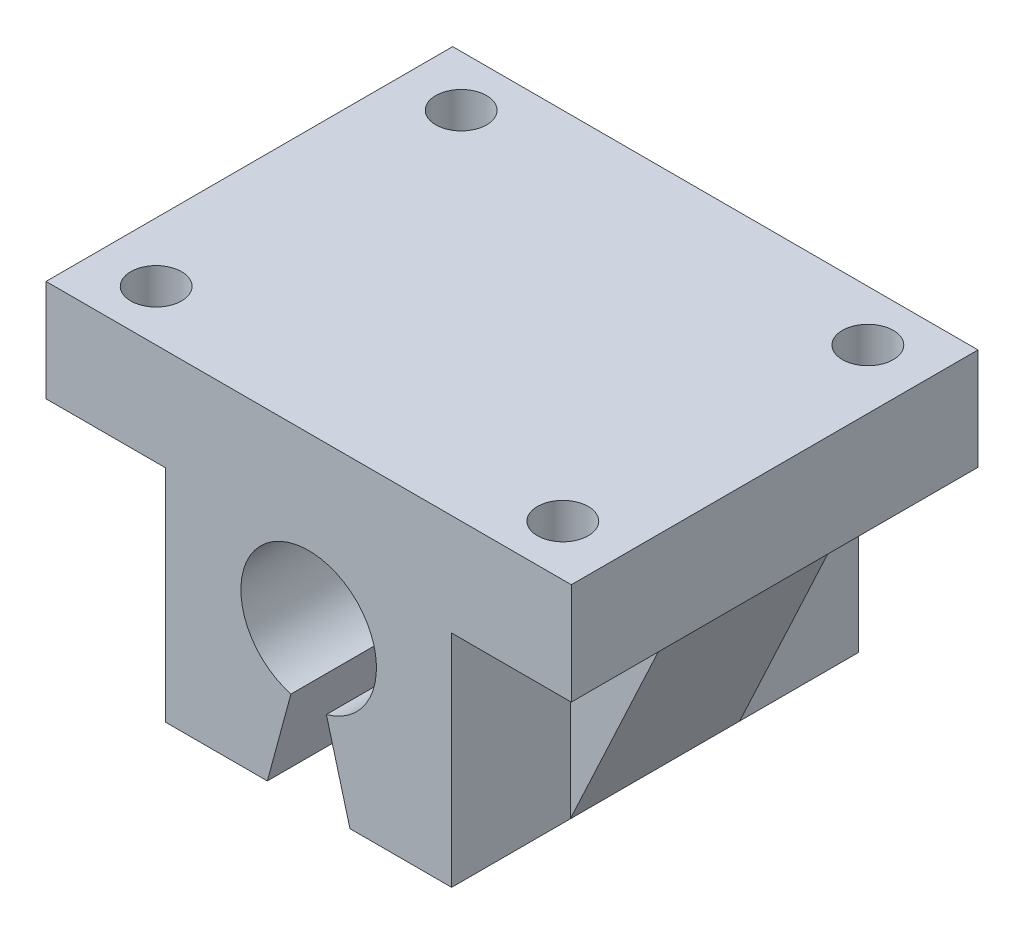
ISO-10303-21;
HEADER;
FILE_DESCRIPTION(('STEP AP214'),'2;1');
FILE_NAME('part.step','',(''),(''),'','','');
FILE_SCHEMA(('AUTOMOTIVE_DESIGN { 1 0 10303 214 1 1 1 1 }'));
ENDSEC;
DATA;
#1=APPLICATION_CONTEXT('core data for automotive mechanical design processes');
#2=APPLICATION_PROTOCOL_DEFINITION('international standard','automotive_design',2000,#1);
#3=PRODUCT_CONTEXT('',#1,'mechanical');
#4=PRODUCT('Part','Part','',(#3));
#5=PRODUCT_RELATED_PRODUCT_CATEGORY('part','',(#4));
#6=PRODUCT_DEFINITION_FORMATION('','',#4);
#7=PRODUCT_DEFINITION_CONTEXT('part definition',#1,'design');
#8=PRODUCT_DEFINITION('design','',#6,#7);
#9=PRODUCT_DEFINITION_SHAPE('','',#8);
#10=(LENGTH_UNIT() NAMED_UNIT(*) SI_UNIT(.MILLI.,.METRE.));
#11=(NAMED_UNIT(*) PLANE_ANGLE_UNIT() SI_UNIT($,.RADIAN.));
#12=(NAMED_UNIT(*) SI_UNIT($,.STERADIAN.) SOLID_ANGLE_UNIT());
#13=UNCERTAINTY_MEASURE_WITH_UNIT(LENGTH_MEASURE(1.E-05),#10,'distance_accuracy_value','');
#14=(GEOMETRIC_REPRESENTATION_CONTEXT(3) GLOBAL_UNCERTAINTY_ASSIGNED_CONTEXT((#13)) GLOBAL_UNIT_ASSIGNED_CONTEXT((#10,
#11,#12)) REPRESENTATION_CONTEXT('',''));
#15=CARTESIAN_POINT('',(0.,0.,0.));
#16=DIRECTION('',(0.,0.,1.));
#17=DIRECTION('',(1.,0.,0.));
#18=AXIS2_PLACEMENT_3D('',#15,#16,#17);
#19=CARTESIAN_POINT('',(0.,-6.,12.));
#20=DIRECTION('',(0.,1.,0.));
#21=DIRECTION('',(0.,0.,1.));
#22=AXIS2_PLACEMENT_3D('',#19,#20,#21);
#23=PLANE('',#22);
#24=CARTESIAN_POINT('',(-12.,-6.,9.));
#25=DIRECTION('',(0.,1.,0.));
#26=DIRECTION('',(0.,0.,1.));
#27=AXIS2_PLACEMENT_3D('',#24,#25,#26);
#28=CIRCLE('',#27,1.5);
#29=CARTESIAN_POINT('',(-12.,-6.,10.5));
#30=VERTEX_POINT('',#29);
#31=EDGE_CURVE('E581',#30,#30,#28,.F.);
#32=ORIENTED_EDGE('',*,*,#31,.F.);
#33=EDGE_LOOP('',(#32));
#34=FACE_BOUND('',#33,.T.);
#35=CARTESIAN_POINT('',(-12.,-6.,-9.));
#36=DIRECTION('',(0.,1.,0.));
#37=DIRECTION('',(0.,0.,1.));
#38=AXIS2_PLACEMENT_3D('',#35,#36,#37);
#39=CIRCLE('',#38,1.5);
#40=CARTESIAN_POINT('',(-12.,-6.,-7.5));
#41=VERTEX_POINT('',#40);
#42=EDGE_CURVE('E593',#41,#41,#39,.F.);
#43=ORIENTED_EDGE('',*,*,#42,.F.);
#44=EDGE_LOOP('',(#43));
#45=FACE_BOUND('',#44,.T.);
#46=DIRECTION('',(-1.,0.,0.));
#47=VECTOR('',#46,1.);
#48=CARTESIAN_POINT('',(-14.5,-6.,5.));
#49=LINE('',#48,#47);
#50=CARTESIAN_POINT('',(-8.43800044398506,-6.,5.));
#51=VERTEX_POINT('',#50);
#52=CARTESIAN_POINT('',(-14.5,-6.,5.));
#53=VERTEX_POINT('',#52);
#54=EDGE_CURVE('E171',#51,#53,#49,.T.);
#55=ORIENTED_EDGE('',*,*,#54,.F.);
#56=DIRECTION('',(0.,0.,-1.));
#57=VECTOR('',#56,1.);
#58=CARTESIAN_POINT('',(-8.43800044398506,-6.,12.));
#59=LINE('',#58,#57);
#60=CARTESIAN_POINT('',(-8.43800044398506,-6.,12.));
#61=VERTEX_POINT('',#60);
#62=EDGE_CURVE('E268',#61,#51,#59,.T.);
#63=ORIENTED_EDGE('',*,*,#62,.F.);
#64=DIRECTION('',(1.,0.,0.));
#65=VECTOR('',#64,1.);
#66=CARTESIAN_POINT('',(0.,-6.,12.));
#67=LINE('',#66,#65);
#68=CARTESIAN_POINT('',(-15.5,-6.,12.));
#69=VERTEX_POINT('',#68);
#70=EDGE_CURVE('E222',#69,#61,#67,.T.);
#71=ORIENTED_EDGE('',*,*,#70,.F.);
#72=DIRECTION('',(0.,0.,-1.));
#73=VECTOR('',#72,1.);
#74=CARTESIAN_POINT('',(-15.5,-6.,12.));
#75=LINE('',#74,#73);
#76=CARTESIAN_POINT('',(-15.5,-6.,-12.));
#77=VERTEX_POINT('',#76);
#78=EDGE_CURVE('E270',#69,#77,#75,.T.);
#79=ORIENTED_EDGE('',*,*,#78,.T.);
#80=DIRECTION('',(1.,0.,0.));
#81=VECTOR('',#80,1.);
#82=CARTESIAN_POINT('',(0.,-6.,-12.));
#83=LINE('',#82,#81);
#84=CARTESIAN_POINT('',(-8.43800044398506,-6.,-12.));
#85=VERTEX_POINT('',#84);
#86=EDGE_CURVE('E249',#77,#85,#83,.T.);
#87=ORIENTED_EDGE('',*,*,#86,.T.);
#88=CARTESIAN_POINT('',(-8.43800044398506,-6.,-5.));
#89=VERTEX_POINT('',#88);
#90=EDGE_CURVE('E267',#89,#85,#59,.T.);
#91=ORIENTED_EDGE('',*,*,#90,.F.);
#92=DIRECTION('',(-1.,0.,0.));
#93=VECTOR('',#92,1.);
#94=CARTESIAN_POINT('',(-14.5,-6.,-5.));
#95=LINE('',#94,#93);
#96=CARTESIAN_POINT('',(-14.5,-6.,-5.));
#97=VERTEX_POINT('',#96);
#98=EDGE_CURVE('E180',#89,#97,#95,.T.);
#99=ORIENTED_EDGE('',*,*,#98,.T.);
#100=DIRECTION('',(0.,0.,-1.));
#101=VECTOR('',#100,1.);
#102=CARTESIAN_POINT('',(-14.5,-6.,5.));
#103=LINE('',#102,#101);
#104=EDGE_CURVE('E164',#53,#97,#103,.T.);
#105=ORIENTED_EDGE('',*,*,#104,.F.);
#106=EDGE_LOOP('',(#55,#63,#71,#79,#87,#91,#99,#105));
#107=FACE_BOUND('',#106,.T.);
#108=ADVANCED_FACE('F35',(#34,#45,#107),#23,.F.);
#109=CARTESIAN_POINT('',(-8.43800044398506,0.,12.));
#110=DIRECTION('',(1.,0.,0.));
#111=DIRECTION('',(0.,1.,0.));
#112=AXIS2_PLACEMENT_3D('',#109,#110,#111);
#113=PLANE('',#112);
#114=DIRECTION('',(0.,1.,0.));
#115=VECTOR('',#114,1.);
#116=CARTESIAN_POINT('',(-8.43800044398506,-6.,5.));
#117=LINE('',#116,#115);
#118=CARTESIAN_POINT('',(-8.43800044398506,-19.,5.));
#119=VERTEX_POINT('',#118);
#120=EDGE_CURVE('E170',#119,#51,#117,.T.);
#121=ORIENTED_EDGE('',*,*,#120,.F.);
#122=DIRECTION('',(0.,0.,-1.));
#123=VECTOR('',#122,1.);
#124=CARTESIAN_POINT('',(-8.43800044398506,-19.,12.));
#125=LINE('',#124,#123);
#126=CARTESIAN_POINT('',(-8.43800044398506,-19.,12.));
#127=VERTEX_POINT('',#126);
#128=EDGE_CURVE('E264',#127,#119,#125,.T.);
#129=ORIENTED_EDGE('',*,*,#128,.F.);
#130=DIRECTION('',(0.,-1.,0.));
#131=VECTOR('',#130,1.);
#132=CARTESIAN_POINT('',(-8.43800044398506,0.,12.));
#133=LINE('',#132,#131);
#134=EDGE_CURVE('E224',#61,#127,#133,.T.);
#135=ORIENTED_EDGE('',*,*,#134,.F.);
#136=ORIENTED_EDGE('',*,*,#62,.T.);
#137=EDGE_LOOP('',(#121,#129,#135,#136));
#138=FACE_BOUND('',#137,.T.);
#139=ADVANCED_FACE('F371',(#138),#113,.F.);
#140=CARTESIAN_POINT('',(8.43800044398507,0.,12.));
#141=DIRECTION('',(-1.,0.,0.));
#142=DIRECTION('',(0.,0.,1.));
#143=AXIS2_PLACEMENT_3D('',#140,#141,#142);
#144=PLANE('',#143);
#145=DIRECTION('',(0.,-1.,0.));
#146=VECTOR('',#145,1.);
#147=CARTESIAN_POINT('',(8.43800044398507,-19.,5.));
#148=LINE('',#147,#146);
#149=CARTESIAN_POINT('',(8.43800044398507,-6.,5.));
#150=VERTEX_POINT('',#149);
#151=CARTESIAN_POINT('',(8.43800044398507,-19.,5.));
#152=VERTEX_POINT('',#151);
#153=EDGE_CURVE('E187',#150,#152,#148,.T.);
#154=ORIENTED_EDGE('',*,*,#153,.F.);
#155=DIRECTION('',(0.,0.,-1.));
#156=VECTOR('',#155,1.);
#157=CARTESIAN_POINT('',(8.43800044398507,-6.,12.));
#158=LINE('',#157,#156);
#159=CARTESIAN_POINT('',(8.43800044398507,-6.,12.));
#160=VERTEX_POINT('',#159);
#161=EDGE_CURVE('E283',#160,#150,#158,.T.);
#162=ORIENTED_EDGE('',*,*,#161,.F.);
#163=DIRECTION('',(0.,1.,0.));
#164=VECTOR('',#163,1.);
#165=CARTESIAN_POINT('',(8.43800044398507,0.,12.));
#166=LINE('',#165,#164);
#167=CARTESIAN_POINT('',(8.43800044398507,-19.,12.));
#168=VERTEX_POINT('',#167);
#169=EDGE_CURVE('E212',#168,#160,#166,.T.);
#170=ORIENTED_EDGE('',*,*,#169,.F.);
#171=DIRECTION('',(0.,0.,-1.));
#172=VECTOR('',#171,1.);
#173=CARTESIAN_POINT('',(8.43800044398507,-19.,12.));
#174=LINE('',#173,#172);
#175=EDGE_CURVE('E287',#168,#152,#174,.T.);
#176=ORIENTED_EDGE('',*,*,#175,.T.);
#177=EDGE_LOOP('',(#154,#162,#170,#176));
#178=FACE_BOUND('',#177,.T.);
#179=ADVANCED_FACE('F314',(#178),#144,.F.);
#180=CARTESIAN_POINT('',(0.,-6.,12.));
#181=DIRECTION('',(0.,1.,0.));
#182=DIRECTION('',(0.,0.,1.));
#183=AXIS2_PLACEMENT_3D('',#180,#181,#182);
#184=PLANE('',#183);
#185=CARTESIAN_POINT('',(12.,-6.,9.));
#186=DIRECTION('',(0.,1.,0.));
#187=DIRECTION('',(0.,0.,1.));
#188=AXIS2_PLACEMENT_3D('',#185,#186,#187);
#189=CIRCLE('',#188,1.5);
#190=CARTESIAN_POINT('',(12.,-6.,10.5));
#191=VERTEX_POINT('',#190);
#192=EDGE_CURVE('E585',#191,#191,#189,.F.);
#193=ORIENTED_EDGE('',*,*,#192,.F.);
#194=EDGE_LOOP('',(#193));
#195=FACE_BOUND('',#194,.T.);
#196=CARTESIAN_POINT('',(12.,-6.,-9.));
#197=DIRECTION('',(0.,1.,0.));
#198=DIRECTION('',(0.,0.,1.));
#199=AXIS2_PLACEMENT_3D('',#196,#197,#198);
#200=CIRCLE('',#199,1.5);
#201=CARTESIAN_POINT('',(12.,-6.,-7.5));
#202=VERTEX_POINT('',#201);
#203=EDGE_CURVE('E594',#202,#202,#200,.F.);
#204=ORIENTED_EDGE('',*,*,#203,.F.);
#205=EDGE_LOOP('',(#204));
#206=FACE_BOUND('',#205,.T.);
#207=DIRECTION('',(-1.,0.,0.));
#208=VECTOR('',#207,1.);
#209=CARTESIAN_POINT('',(8.43800044398507,-6.,5.));
#210=LINE('',#209,#208);
#211=CARTESIAN_POINT('',(14.5,-6.,5.));
#212=VERTEX_POINT('',#211);
#213=EDGE_CURVE('E193',#212,#150,#210,.T.);
#214=ORIENTED_EDGE('',*,*,#213,.F.);
#215=DIRECTION('',(0.,0.,-1.));
#216=VECTOR('',#215,1.);
#217=CARTESIAN_POINT('',(14.5,-6.,5.));
#218=LINE('',#217,#216);
#219=CARTESIAN_POINT('',(14.5,-6.,-5.));
#220=VERTEX_POINT('',#219);
#221=EDGE_CURVE('E194',#212,#220,#218,.T.);
#222=ORIENTED_EDGE('',*,*,#221,.T.);
#223=DIRECTION('',(-1.,0.,0.));
#224=VECTOR('',#223,1.);
#225=CARTESIAN_POINT('',(8.43800044398507,-6.,-5.));
#226=LINE('',#225,#224);
#227=CARTESIAN_POINT('',(8.43800044398507,-6.,-5.));
#228=VERTEX_POINT('',#227);
#229=EDGE_CURVE('E191',#220,#228,#226,.T.);
#230=ORIENTED_EDGE('',*,*,#229,.T.);
#231=CARTESIAN_POINT('',(8.43800044398507,-6.,-12.));
#232=VERTEX_POINT('',#231);
#233=EDGE_CURVE('E282',#228,#232,#158,.T.);
#234=ORIENTED_EDGE('',*,*,#233,.T.);
#235=DIRECTION('',(1.,0.,0.));
#236=VECTOR('',#235,1.);
#237=CARTESIAN_POINT('',(0.,-6.,-12.));
#238=LINE('',#237,#236);
#239=CARTESIAN_POINT('',(15.5,-5.99999999999999,-12.));
#240=VERTEX_POINT('',#239);
#241=EDGE_CURVE('E241',#232,#240,#238,.T.);
#242=ORIENTED_EDGE('',*,*,#241,.T.);
#243=DIRECTION('',(0.,0.,-1.));
#244=VECTOR('',#243,1.);
#245=CARTESIAN_POINT('',(15.5,-5.99999999999999,12.));
#246=LINE('',#245,#244);
#247=CARTESIAN_POINT('',(15.5,-5.99999999999999,12.));
#248=VERTEX_POINT('',#247);
#249=EDGE_CURVE('E279',#248,#240,#246,.T.);
#250=ORIENTED_EDGE('',*,*,#249,.F.);
#251=DIRECTION('',(1.,0.,0.));
#252=VECTOR('',#251,1.);
#253=CARTESIAN_POINT('',(0.,-6.,12.));
#254=LINE('',#253,#252);
#255=EDGE_CURVE('E214',#160,#248,#254,.T.);
#256=ORIENTED_EDGE('',*,*,#255,.F.);
#257=ORIENTED_EDGE('',*,*,#161,.T.);
#258=EDGE_LOOP('',(#214,#222,#230,#234,#242,#250,#256,#257));
#259=FACE_BOUND('',#258,.T.);
#260=ADVANCED_FACE('F355',(#195,#206,#259),#184,.F.);
#261=CARTESIAN_POINT('',(0.,-10.,12.));
#262=DIRECTION('',(0.,0.,-1.));
#263=DIRECTION('',(-1.,0.,0.));
#264=AXIS2_PLACEMENT_3D('',#261,#262,#263);
#265=CYLINDRICAL_SURFACE('',#264,4.);
#266=CARTESIAN_POINT('',(0.,-10.,-12.));
#267=DIRECTION('',(0.,0.,1.));
#268=DIRECTION('',(1.,0.,0.));
#269=AXIS2_PLACEMENT_3D('',#266,#267,#268);
#270=CIRCLE('',#269,4.);
#271=CARTESIAN_POINT('',(1.04586191274877,-13.8608513127886,-12.));
#272=VERTEX_POINT('',#271);
#273=CARTESIAN_POINT('',(-1.04586191274877,-13.8608513127886,-12.));
#274=VERTEX_POINT('',#273);
#275=EDGE_CURVE('E203',#272,#274,#270,.T.);
#276=ORIENTED_EDGE('',*,*,#275,.F.);
#277=DIRECTION('',(0.,0.,-1.));
#278=VECTOR('',#277,1.);
#279=CARTESIAN_POINT('',(1.04586191274877,-13.8608513127886,12.));
#280=LINE('',#279,#278);
#281=CARTESIAN_POINT('',(1.04586191274877,-13.8608513127886,12.));
#282=VERTEX_POINT('',#281);
#283=EDGE_CURVE('E11',#282,#272,#280,.T.);
#284=ORIENTED_EDGE('',*,*,#283,.F.);
#285=CARTESIAN_POINT('',(0.,-10.,12.));
#286=DIRECTION('',(0.,0.,1.));
#287=DIRECTION('',(1.,0.,0.));
#288=AXIS2_PLACEMENT_3D('',#285,#286,#287);
#289=CIRCLE('',#288,4.);
#290=CARTESIAN_POINT('',(-1.04586191274877,-13.8608513127886,12.));
#291=VERTEX_POINT('',#290);
#292=EDGE_CURVE('E204',#282,#291,#289,.T.);
#293=ORIENTED_EDGE('',*,*,#292,.T.);
#294=DIRECTION('',(0.,0.,-1.));
#295=VECTOR('',#294,1.);
#296=CARTESIAN_POINT('',(-1.04586191274877,-13.8608513127886,12.));
#297=LINE('',#296,#295);
#298=EDGE_CURVE('E230',#291,#274,#297,.T.);
#299=ORIENTED_EDGE('',*,*,#298,.T.);
#300=EDGE_LOOP('',(#276,#284,#293,#299));
#301=FACE_BOUND('',#300,.T.);
#302=ADVANCED_FACE('F37',(#301),#265,.F.);
#303=CARTESIAN_POINT('',(-2.52369833676981,-0.683641962836577,12.));
#304=DIRECTION('',(0.965212828197151,0.261465478187193,0.));
#305=DIRECTION('',(-0.261465478187193,0.965212828197151,0.));
#306=AXIS2_PLACEMENT_3D('',#303,#304,#305);
#307=PLANE('',#306);
#308=DIRECTION('',(0.261465478187193,-0.965212828197151,0.));
#309=VECTOR('',#308,1.);
#310=CARTESIAN_POINT('',(-2.52369833676981,-0.683641962836577,-12.));
#311=LINE('',#310,#309);
#312=CARTESIAN_POINT('',(2.43800044398507,-19.,-12.));
#313=VERTEX_POINT('',#312);
#314=EDGE_CURVE('E233',#272,#313,#311,.T.);
#315=ORIENTED_EDGE('',*,*,#314,.T.);
#316=DIRECTION('',(0.,0.,-1.));
#317=VECTOR('',#316,1.);
#318=CARTESIAN_POINT('',(2.43800044398507,-19.,12.));
#319=LINE('',#318,#317);
#320=CARTESIAN_POINT('',(2.43800044398507,-19.,12.));
#321=VERTEX_POINT('',#320);
#322=EDGE_CURVE('E43',#321,#313,#319,.T.);
#323=ORIENTED_EDGE('',*,*,#322,.F.);
#324=DIRECTION('',(0.261465478187193,-0.965212828197151,0.));
#325=VECTOR('',#324,1.);
#326=CARTESIAN_POINT('',(-2.52369833676981,-0.683641962836577,12.));
#327=LINE('',#326,#325);
#328=EDGE_CURVE('E207',#282,#321,#327,.T.);
#329=ORIENTED_EDGE('',*,*,#328,.F.);
#330=ORIENTED_EDGE('',*,*,#283,.T.);
#331=EDGE_LOOP('',(#315,#323,#329,#330));
#332=FACE_BOUND('',#331,.T.);
#333=ADVANCED_FACE('F321',(#332),#307,.F.);
#334=CARTESIAN_POINT('',(0.,-19.,12.));
#335=DIRECTION('',(0.,1.,0.));
#336=DIRECTION('',(-1.,0.,0.));
#337=AXIS2_PLACEMENT_3D('',#334,#335,#336);
#338=PLANE('',#337);
#339=DIRECTION('',(1.,0.,0.));
#340=VECTOR('',#339,1.);
#341=CARTESIAN_POINT('',(0.,-19.,-12.));
#342=LINE('',#341,#340);
#343=CARTESIAN_POINT('',(8.43800044398507,-19.,-12.));
#344=VERTEX_POINT('',#343);
#345=EDGE_CURVE('E235',#313,#344,#342,.T.);
#346=ORIENTED_EDGE('',*,*,#345,.T.);
#347=CARTESIAN_POINT('',(8.43800044398507,-19.,-5.));
#348=VERTEX_POINT('',#347);
#349=EDGE_CURVE('E286',#348,#344,#174,.T.);
#350=ORIENTED_EDGE('',*,*,#349,.F.);
#351=DIRECTION('',(0.,0.,-1.));
#352=VECTOR('',#351,1.);
#353=CARTESIAN_POINT('',(8.43800044398507,-19.,5.));
#354=LINE('',#353,#352);
#355=EDGE_CURVE('E200',#152,#348,#354,.T.);
#356=ORIENTED_EDGE('',*,*,#355,.F.);
#357=ORIENTED_EDGE('',*,*,#175,.F.);
#358=DIRECTION('',(1.,0.,0.));
#359=VECTOR('',#358,1.);
#360=CARTESIAN_POINT('',(0.,-19.,12.));
#361=LINE('',#360,#359);
#362=EDGE_CURVE('E210',#321,#168,#361,.T.);
#363=ORIENTED_EDGE('',*,*,#362,.F.);
#364=ORIENTED_EDGE('',*,*,#322,.T.);
#365=EDGE_LOOP('',(#346,#350,#356,#357,#363,#364));
#366=FACE_BOUND('',#365,.T.);
#367=ADVANCED_FACE('F294',(#366),#338,.F.);
#368=ORIENTED_EDGE('',*,*,#233,.F.);
#369=DIRECTION('',(0.,-1.,0.));
#370=VECTOR('',#369,1.);
#371=CARTESIAN_POINT('',(8.43800044398507,-19.,-5.));
#372=LINE('',#371,#370);
#373=EDGE_CURVE('E58',#228,#348,#372,.T.);
#374=ORIENTED_EDGE('',*,*,#373,.T.);
#375=ORIENTED_EDGE('',*,*,#349,.T.);
#376=DIRECTION('',(0.,1.,0.));
#377=VECTOR('',#376,1.);
#378=CARTESIAN_POINT('',(8.43800044398507,0.,-12.));
#379=LINE('',#378,#377);
#380=EDGE_CURVE('E238',#344,#232,#379,.T.);
#381=ORIENTED_EDGE('',*,*,#380,.T.);
#382=EDGE_LOOP('',(#368,#374,#375,#381));
#383=FACE_BOUND('',#382,.T.);
#384=ADVANCED_FACE('F308',(#383),#144,.F.);
#385=CARTESIAN_POINT('',(15.5,0.,12.));
#386=DIRECTION('',(-1.,0.,0.));
#387=DIRECTION('',(0.,0.,1.));
#388=AXIS2_PLACEMENT_3D('',#385,#386,#387);
#389=PLANE('',#388);
#390=DIRECTION('',(0.,1.,0.));
#391=VECTOR('',#390,1.);
#392=CARTESIAN_POINT('',(15.5,0.,-12.));
#393=LINE('',#392,#391);
#394=CARTESIAN_POINT('',(15.5,0.,-12.));
#395=VERTEX_POINT('',#394);
#396=EDGE_CURVE('E243',#240,#395,#393,.T.);
#397=ORIENTED_EDGE('',*,*,#396,.T.);
#398=DIRECTION('',(0.,0.,-1.));
#399=VECTOR('',#398,1.);
#400=CARTESIAN_POINT('',(15.5,0.,12.));
#401=LINE('',#400,#399);
#402=CARTESIAN_POINT('',(15.5,0.,12.));
#403=VERTEX_POINT('',#402);
#404=EDGE_CURVE('E276',#403,#395,#401,.T.);
#405=ORIENTED_EDGE('',*,*,#404,.F.);
#406=DIRECTION('',(0.,1.,0.));
#407=VECTOR('',#406,1.);
#408=CARTESIAN_POINT('',(15.5,0.,12.));
#409=LINE('',#408,#407);
#410=EDGE_CURVE('E216',#248,#403,#409,.T.);
#411=ORIENTED_EDGE('',*,*,#410,.F.);
#412=ORIENTED_EDGE('',*,*,#249,.T.);
#413=EDGE_LOOP('',(#397,#405,#411,#412));
#414=FACE_BOUND('',#413,.T.);
#415=ADVANCED_FACE('F351',(#414),#389,.F.);
#416=CARTESIAN_POINT('',(0.,0.,12.));
#417=DIRECTION('',(0.,-1.,0.));
#418=DIRECTION('',(0.,0.,-1.));
#419=AXIS2_PLACEMENT_3D('',#416,#417,#418);
#420=PLANE('',#419);
#421=CARTESIAN_POINT('',(-12.,0.,9.));
#422=DIRECTION('',(0.,1.,0.));
#423=DIRECTION('',(0.,0.,1.));
#424=AXIS2_PLACEMENT_3D('',#421,#422,#423);
#425=CIRCLE('',#424,1.5);
#426=CARTESIAN_POINT('',(-12.,0.,10.5));
#427=VERTEX_POINT('',#426);
#428=EDGE_CURVE('E579',#427,#427,#425,.T.);
#429=ORIENTED_EDGE('',*,*,#428,.F.);
#430=EDGE_LOOP('',(#429));
#431=FACE_BOUND('',#430,.T.);
#432=CARTESIAN_POINT('',(12.,0.,9.));
#433=DIRECTION('',(0.,1.,0.));
#434=DIRECTION('',(0.,0.,1.));
#435=AXIS2_PLACEMENT_3D('',#432,#433,#434);
#436=CIRCLE('',#435,1.5);
#437=CARTESIAN_POINT('',(12.,0.,10.5));
#438=VERTEX_POINT('',#437);
#439=EDGE_CURVE('E582',#438,#438,#436,.T.);
#440=ORIENTED_EDGE('',*,*,#439,.F.);
#441=EDGE_LOOP('',(#440));
#442=FACE_BOUND('',#441,.T.);
#443=CARTESIAN_POINT('',(12.,0.,-9.));
#444=DIRECTION('',(0.,1.,0.));
#445=DIRECTION('',(0.,0.,1.));
#446=AXIS2_PLACEMENT_3D('',#443,#444,#445);
#447=CIRCLE('',#446,1.5);
#448=CARTESIAN_POINT('',(12.,0.,-7.5));
#449=VERTEX_POINT('',#448);
#450=EDGE_CURVE('E604',#449,#449,#447,.T.);
#451=ORIENTED_EDGE('',*,*,#450,.F.);
#452=EDGE_LOOP('',(#451));
#453=FACE_BOUND('',#452,.T.);
#454=CARTESIAN_POINT('',(-12.,0.,-9.));
#455=DIRECTION('',(0.,1.,0.));
#456=DIRECTION('',(0.,0.,1.));
#457=AXIS2_PLACEMENT_3D('',#454,#455,#456);
#458=CIRCLE('',#457,1.5);
#459=CARTESIAN_POINT('',(-12.,0.,-7.5));
#460=VERTEX_POINT('',#459);
#461=EDGE_CURVE('E590',#460,#460,#458,.T.);
#462=ORIENTED_EDGE('',*,*,#461,.F.);
#463=EDGE_LOOP('',(#462));
#464=FACE_BOUND('',#463,.T.);
#465=DIRECTION('',(-1.,0.,0.));
#466=VECTOR('',#465,1.);
#467=CARTESIAN_POINT('',(0.,0.,-12.));
#468=LINE('',#467,#466);
#469=CARTESIAN_POINT('',(-15.5,0.,-12.));
#470=VERTEX_POINT('',#469);
#471=EDGE_CURVE('E245',#395,#470,#468,.T.);
#472=ORIENTED_EDGE('',*,*,#471,.T.);
#473=DIRECTION('',(0.,0.,-1.));
#474=VECTOR('',#473,1.);
#475=CARTESIAN_POINT('',(-15.5,0.,12.));
#476=LINE('',#475,#474);
#477=CARTESIAN_POINT('',(-15.5,0.,12.));
#478=VERTEX_POINT('',#477);
#479=EDGE_CURVE('E273',#478,#470,#476,.T.);
#480=ORIENTED_EDGE('',*,*,#479,.F.);
#481=DIRECTION('',(-1.,0.,0.));
#482=VECTOR('',#481,1.);
#483=CARTESIAN_POINT('',(0.,0.,12.));
#484=LINE('',#483,#482);
#485=EDGE_CURVE('E218',#403,#478,#484,.T.);
#486=ORIENTED_EDGE('',*,*,#485,.F.);
#487=ORIENTED_EDGE('',*,*,#404,.T.);
#488=EDGE_LOOP('',(#472,#480,#486,#487));
#489=FACE_BOUND('',#488,.T.);
#490=ADVANCED_FACE('F348',(#431,#442,#453,#464,#489),#420,.F.);
#491=CARTESIAN_POINT('',(-15.5,0.,12.));
#492=DIRECTION('',(1.,0.,0.));
#493=DIRECTION('',(0.,0.,-1.));
#494=AXIS2_PLACEMENT_3D('',#491,#492,#493);
#495=PLANE('',#494);
#496=DIRECTION('',(0.,-1.,0.));
#497=VECTOR('',#496,1.);
#498=CARTESIAN_POINT('',(-15.5,0.,-12.));
#499=LINE('',#498,#497);
#500=EDGE_CURVE('E247',#470,#77,#499,.T.);
#501=ORIENTED_EDGE('',*,*,#500,.T.);
#502=ORIENTED_EDGE('',*,*,#78,.F.);
#503=DIRECTION('',(0.,-1.,0.));
#504=VECTOR('',#503,1.);
#505=CARTESIAN_POINT('',(-15.5,0.,12.));
#506=LINE('',#505,#504);
#507=EDGE_CURVE('E220',#478,#69,#506,.T.);
#508=ORIENTED_EDGE('',*,*,#507,.F.);
#509=ORIENTED_EDGE('',*,*,#479,.T.);
#510=EDGE_LOOP('',(#501,#502,#508,#509));
#511=FACE_BOUND('',#510,.T.);
#512=ADVANCED_FACE('F344',(#511),#495,.F.);
#513=CARTESIAN_POINT('',(-8.43800044398506,-19.,-5.));
#514=VERTEX_POINT('',#513);
#515=CARTESIAN_POINT('',(-8.43800044398506,-19.,-12.));
#516=VERTEX_POINT('',#515);
#517=EDGE_CURVE('E263',#514,#516,#125,.T.);
#518=ORIENTED_EDGE('',*,*,#517,.F.);
#519=DIRECTION('',(0.,1.,0.));
#520=VECTOR('',#519,1.);
#521=CARTESIAN_POINT('',(-8.43800044398506,-6.,-5.));
#522=LINE('',#521,#520);
#523=EDGE_CURVE('E50',#514,#89,#522,.T.);
#524=ORIENTED_EDGE('',*,*,#523,.T.);
#525=ORIENTED_EDGE('',*,*,#90,.T.);
#526=DIRECTION('',(0.,-1.,0.));
#527=VECTOR('',#526,1.);
#528=CARTESIAN_POINT('',(-8.43800044398506,0.,-12.));
#529=LINE('',#528,#527);
#530=EDGE_CURVE('E252',#85,#516,#529,.T.);
#531=ORIENTED_EDGE('',*,*,#530,.T.);
#532=EDGE_LOOP('',(#518,#524,#525,#531));
#533=FACE_BOUND('',#532,.T.);
#534=ADVANCED_FACE('F336',(#533),#113,.F.);
#535=CARTESIAN_POINT('',(0.,-19.,12.));
#536=DIRECTION('',(0.,1.,0.));
#537=DIRECTION('',(0.,0.,1.));
#538=AXIS2_PLACEMENT_3D('',#535,#536,#537);
#539=PLANE('',#538);
#540=DIRECTION('',(1.,0.,0.));
#541=VECTOR('',#540,1.);
#542=CARTESIAN_POINT('',(0.,-19.,-12.));
#543=LINE('',#542,#541);
#544=CARTESIAN_POINT('',(-2.43800044398506,-19.,-12.));
#545=VERTEX_POINT('',#544);
#546=EDGE_CURVE('E255',#516,#545,#543,.T.);
#547=ORIENTED_EDGE('',*,*,#546,.T.);
#548=DIRECTION('',(0.,0.,-1.));
#549=VECTOR('',#548,1.);
#550=CARTESIAN_POINT('',(-2.43800044398506,-19.,12.));
#551=LINE('',#550,#549);
#552=CARTESIAN_POINT('',(-2.43800044398506,-19.,12.));
#553=VERTEX_POINT('',#552);
#554=EDGE_CURVE('E260',#553,#545,#551,.T.);
#555=ORIENTED_EDGE('',*,*,#554,.F.);
#556=DIRECTION('',(1.,0.,0.));
#557=VECTOR('',#556,1.);
#558=CARTESIAN_POINT('',(0.,-19.,12.));
#559=LINE('',#558,#557);
#560=EDGE_CURVE('E226',#127,#553,#559,.T.);
#561=ORIENTED_EDGE('',*,*,#560,.F.);
#562=ORIENTED_EDGE('',*,*,#128,.T.);
#563=DIRECTION('',(0.,0.,-1.));
#564=VECTOR('',#563,1.);
#565=CARTESIAN_POINT('',(-8.43800044398506,-19.,5.));
#566=LINE('',#565,#564);
#567=EDGE_CURVE('E167',#119,#514,#566,.T.);
#568=ORIENTED_EDGE('',*,*,#567,.T.);
#569=ORIENTED_EDGE('',*,*,#517,.T.);
#570=EDGE_LOOP('',(#547,#555,#561,#562,#568,#569));
#571=FACE_BOUND('',#570,.T.);
#572=ADVANCED_FACE('F333',(#571),#539,.F.);
#573=CARTESIAN_POINT('',(2.52369833676981,-0.683641962836573,12.));
#574=DIRECTION('',(-0.965212828197151,0.261465478187193,0.));
#575=DIRECTION('',(-0.261465478187193,-0.965212828197151,0.));
#576=AXIS2_PLACEMENT_3D('',#573,#574,#575);
#577=PLANE('',#576);
#578=DIRECTION('',(0.261465478187193,0.965212828197151,0.));
#579=VECTOR('',#578,1.);
#580=CARTESIAN_POINT('',(2.52369833676981,-0.683641962836573,-12.));
#581=LINE('',#580,#579);
#582=EDGE_CURVE('E208',#545,#274,#581,.T.);
#583=ORIENTED_EDGE('',*,*,#582,.T.);
#584=ORIENTED_EDGE('',*,*,#298,.F.);
#585=DIRECTION('',(0.261465478187193,0.965212828197151,0.));
#586=VECTOR('',#585,1.);
#587=CARTESIAN_POINT('',(2.52369833676981,-0.683641962836573,12.));
#588=LINE('',#587,#586);
#589=EDGE_CURVE('E228',#553,#291,#588,.T.);
#590=ORIENTED_EDGE('',*,*,#589,.F.);
#591=ORIENTED_EDGE('',*,*,#554,.T.);
#592=EDGE_LOOP('',(#583,#584,#590,#591));
#593=FACE_BOUND('',#592,.T.);
#594=ADVANCED_FACE('F328',(#593),#577,.F.);
#595=CARTESIAN_POINT('',(0.,0.,12.));
#596=DIRECTION('',(0.,0.,1.));
#597=DIRECTION('',(1.,0.,0.));
#598=AXIS2_PLACEMENT_3D('',#595,#596,#597);
#599=PLANE('',#598);
#600=ORIENTED_EDGE('',*,*,#292,.F.);
#601=ORIENTED_EDGE('',*,*,#328,.T.);
#602=ORIENTED_EDGE('',*,*,#362,.T.);
#603=ORIENTED_EDGE('',*,*,#169,.T.);
#604=ORIENTED_EDGE('',*,*,#255,.T.);
#605=ORIENTED_EDGE('',*,*,#410,.T.);
#606=ORIENTED_EDGE('',*,*,#485,.T.);
#607=ORIENTED_EDGE('',*,*,#507,.T.);
#608=ORIENTED_EDGE('',*,*,#70,.T.);
#609=ORIENTED_EDGE('',*,*,#134,.T.);
#610=ORIENTED_EDGE('',*,*,#560,.T.);
#611=ORIENTED_EDGE('',*,*,#589,.T.);
#612=EDGE_LOOP('',(#600,#601,#602,#603,#604,#605,#606,#607,#608,#609,#610,#611));
#613=FACE_BOUND('',#612,.T.);
#614=ADVANCED_FACE('F319',(#613),#599,.T.);
#615=CARTESIAN_POINT('',(0.,0.,-12.));
#616=DIRECTION('',(0.,0.,1.));
#617=DIRECTION('',(1.,0.,0.));
#618=AXIS2_PLACEMENT_3D('',#615,#616,#617);
#619=PLANE('',#618);
#620=ORIENTED_EDGE('',*,*,#275,.T.);
#621=ORIENTED_EDGE('',*,*,#582,.F.);
#622=ORIENTED_EDGE('',*,*,#546,.F.);
#623=ORIENTED_EDGE('',*,*,#530,.F.);
#624=ORIENTED_EDGE('',*,*,#86,.F.);
#625=ORIENTED_EDGE('',*,*,#500,.F.);
#626=ORIENTED_EDGE('',*,*,#471,.F.);
#627=ORIENTED_EDGE('',*,*,#396,.F.);
#628=ORIENTED_EDGE('',*,*,#241,.F.);
#629=ORIENTED_EDGE('',*,*,#380,.F.);
#630=ORIENTED_EDGE('',*,*,#345,.F.);
#631=ORIENTED_EDGE('',*,*,#314,.F.);
#632=EDGE_LOOP('',(#620,#621,#622,#623,#624,#625,#626,#627,#628,#629,#630,#631));
#633=FACE_BOUND('',#632,.T.);
#634=ADVANCED_FACE('F302',(#633),#619,.F.);
#635=CARTESIAN_POINT('',(8.43800044398507,-19.,5.));
#636=DIRECTION('',(-0.906307787036651,0.422618261740697,0.));
#637=DIRECTION('',(-0.422618261740697,-0.906307787036651,0.));
#638=AXIS2_PLACEMENT_3D('',#635,#636,#637);
#639=PLANE('',#638);
#640=DIRECTION('',(0.422618261740697,0.906307787036651,0.));
#641=VECTOR('',#640,1.);
#642=CARTESIAN_POINT('',(8.43800044398507,-19.,-5.));
#643=LINE('',#642,#641);
#644=EDGE_CURVE('E182',#348,#220,#643,.T.);
#645=ORIENTED_EDGE('',*,*,#644,.T.);
#646=ORIENTED_EDGE('',*,*,#221,.F.);
#647=DIRECTION('',(0.422618261740697,0.906307787036651,0.));
#648=VECTOR('',#647,1.);
#649=CARTESIAN_POINT('',(8.43800044398507,-19.,5.));
#650=LINE('',#649,#648);
#651=EDGE_CURVE('E190',#152,#212,#650,.T.);
#652=ORIENTED_EDGE('',*,*,#651,.F.);
#653=ORIENTED_EDGE('',*,*,#355,.T.);
#654=EDGE_LOOP('',(#645,#646,#652,#653));
#655=FACE_BOUND('',#654,.T.);
#656=ADVANCED_FACE('F358',(#655),#639,.F.);
#657=CARTESIAN_POINT('',(0.,0.,5.));
#658=DIRECTION('',(0.,0.,-1.));
#659=DIRECTION('',(-1.,0.,0.));
#660=AXIS2_PLACEMENT_3D('',#657,#658,#659);
#661=PLANE('',#660);
#662=ORIENTED_EDGE('',*,*,#153,.T.);
#663=ORIENTED_EDGE('',*,*,#651,.T.);
#664=ORIENTED_EDGE('',*,*,#213,.T.);
#665=EDGE_LOOP('',(#662,#663,#664));
#666=FACE_BOUND('',#665,.T.);
#667=ADVANCED_FACE('F360',(#666),#661,.F.);
#668=CARTESIAN_POINT('',(0.,0.,-5.));
#669=DIRECTION('',(0.,0.,-1.));
#670=DIRECTION('',(-1.,0.,0.));
#671=AXIS2_PLACEMENT_3D('',#668,#669,#670);
#672=PLANE('',#671);
#673=ORIENTED_EDGE('',*,*,#373,.F.);
#674=ORIENTED_EDGE('',*,*,#229,.F.);
#675=ORIENTED_EDGE('',*,*,#644,.F.);
#676=EDGE_LOOP('',(#673,#674,#675));
#677=FACE_BOUND('',#676,.T.);
#678=ADVANCED_FACE('F357',(#677),#672,.T.);
#679=CARTESIAN_POINT('',(-14.5,-6.,5.));
#680=DIRECTION('',(0.906307787036651,0.422618261740697,0.));
#681=DIRECTION('',(-0.422618261740697,0.906307787036651,0.));
#682=AXIS2_PLACEMENT_3D('',#679,#680,#681);
#683=PLANE('',#682);
#684=DIRECTION('',(0.422618261740697,-0.906307787036651,0.));
#685=VECTOR('',#684,1.);
#686=CARTESIAN_POINT('',(-14.5,-6.,-5.));
#687=LINE('',#686,#685);
#688=EDGE_CURVE('E599',#97,#514,#687,.T.);
#689=ORIENTED_EDGE('',*,*,#688,.T.);
#690=ORIENTED_EDGE('',*,*,#567,.F.);
#691=DIRECTION('',(0.422618261740697,-0.906307787036651,0.));
#692=VECTOR('',#691,1.);
#693=CARTESIAN_POINT('',(-14.5,-6.,5.));
#694=LINE('',#693,#692);
#695=EDGE_CURVE('E160',#53,#119,#694,.T.);
#696=ORIENTED_EDGE('',*,*,#695,.F.);
#697=ORIENTED_EDGE('',*,*,#104,.T.);
#698=EDGE_LOOP('',(#689,#690,#696,#697));
#699=FACE_BOUND('',#698,.T.);
#700=ADVANCED_FACE('F162',(#699),#683,.F.);
#701=CARTESIAN_POINT('',(0.,0.,5.));
#702=DIRECTION('',(0.,0.,-1.));
#703=DIRECTION('',(-1.,0.,0.));
#704=AXIS2_PLACEMENT_3D('',#701,#702,#703);
#705=PLANE('',#704);
#706=ORIENTED_EDGE('',*,*,#54,.T.);
#707=ORIENTED_EDGE('',*,*,#695,.T.);
#708=ORIENTED_EDGE('',*,*,#120,.T.);
#709=EDGE_LOOP('',(#706,#707,#708));
#710=FACE_BOUND('',#709,.T.);
#711=ADVANCED_FACE('F174',(#710),#705,.F.);
#712=CARTESIAN_POINT('',(0.,0.,-5.));
#713=DIRECTION('',(0.,0.,-1.));
#714=DIRECTION('',(-1.,0.,0.));
#715=AXIS2_PLACEMENT_3D('',#712,#713,#714);
#716=PLANE('',#715);
#717=ORIENTED_EDGE('',*,*,#98,.F.);
#718=ORIENTED_EDGE('',*,*,#523,.F.);
#719=ORIENTED_EDGE('',*,*,#688,.F.);
#720=EDGE_LOOP('',(#717,#718,#719));
#721=FACE_BOUND('',#720,.T.);
#722=ADVANCED_FACE('F519',(#721),#716,.T.);
#723=CARTESIAN_POINT('',(-12.,-19.001,-9.));
#724=DIRECTION('',(0.,1.,0.));
#725=DIRECTION('',(0.,0.,1.));
#726=AXIS2_PLACEMENT_3D('',#723,#724,#725);
#727=CYLINDRICAL_SURFACE('',#726,1.5);
#728=ORIENTED_EDGE('',*,*,#461,.T.);
#729=EDGE_LOOP('',(#728));
#730=FACE_BOUND('',#729,.T.);
#731=ORIENTED_EDGE('',*,*,#42,.T.);
#732=EDGE_LOOP('',(#731));
#733=FACE_BOUND('',#732,.T.);
#734=ADVANCED_FACE('F527',(#730,#733),#727,.F.);
#735=CARTESIAN_POINT('',(12.,-19.001,-9.));
#736=DIRECTION('',(0.,1.,0.));
#737=DIRECTION('',(0.,0.,1.));
#738=AXIS2_PLACEMENT_3D('',#735,#736,#737);
#739=CYLINDRICAL_SURFACE('',#738,1.5);
#740=ORIENTED_EDGE('',*,*,#450,.T.);
#741=EDGE_LOOP('',(#740));
#742=FACE_BOUND('',#741,.T.);
#743=ORIENTED_EDGE('',*,*,#203,.T.);
#744=EDGE_LOOP('',(#743));
#745=FACE_BOUND('',#744,.T.);
#746=ADVANCED_FACE('F542',(#742,#745),#739,.F.);
#747=CARTESIAN_POINT('',(12.,-19.001,9.));
#748=DIRECTION('',(0.,1.,0.));
#749=DIRECTION('',(0.,0.,1.));
#750=AXIS2_PLACEMENT_3D('',#747,#748,#749);
#751=CYLINDRICAL_SURFACE('',#750,1.5);
#752=ORIENTED_EDGE('',*,*,#439,.T.);
#753=EDGE_LOOP('',(#752));
#754=FACE_BOUND('',#753,.T.);
#755=ORIENTED_EDGE('',*,*,#192,.T.);
#756=EDGE_LOOP('',(#755));
#757=FACE_BOUND('',#756,.T.);
#758=ADVANCED_FACE('F549',(#754,#757),#751,.F.);
#759=CARTESIAN_POINT('',(-12.,-19.001,9.));
#760=DIRECTION('',(0.,1.,0.));
#761=DIRECTION('',(0.,0.,1.));
#762=AXIS2_PLACEMENT_3D('',#759,#760,#761);
#763=CYLINDRICAL_SURFACE('',#762,1.5);
#764=ORIENTED_EDGE('',*,*,#428,.T.);
#765=EDGE_LOOP('',(#764));
#766=FACE_BOUND('',#765,.T.);
#767=ORIENTED_EDGE('',*,*,#31,.T.);
#768=EDGE_LOOP('',(#767));
#769=FACE_BOUND('',#768,.T.);
#770=ADVANCED_FACE('F557',(#766,#769),#763,.F.);
#771=CLOSED_SHELL('',(#108,#139,#179,#260,#302,#333,#367,#384,#415,#490,#512,#534,#572,#594,
#614,#634,#656,#667,#678,#700,#711,#722,#734,#746,#758,#770));
#772=MANIFOLD_SOLID_BREP('B2',#771);
#773=ADVANCED_BREP_SHAPE_REPRESENTATION('',(#18,#772),#14);
#774=SHAPE_DEFINITION_REPRESENTATION(#9,#773);
ENDSEC;
END-ISO-10303-21;
